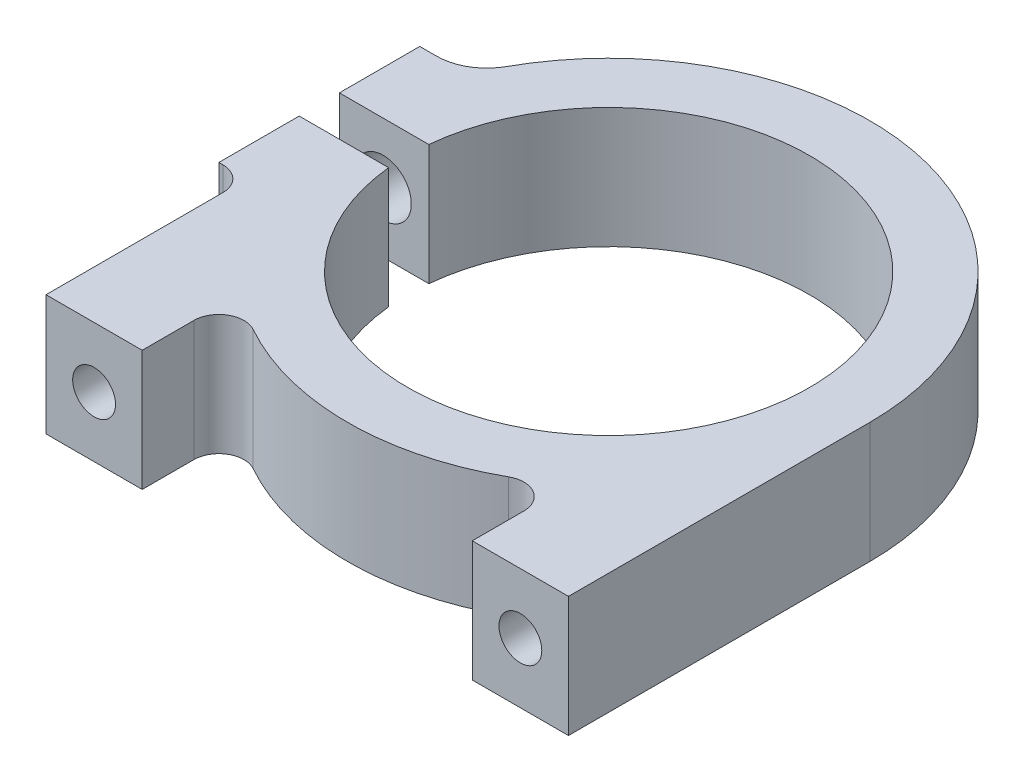
ISO-10303-21;
HEADER;
FILE_DESCRIPTION(('STEP AP214'),'2;1');
FILE_NAME('part.step','',(''),(''),'','','');
FILE_SCHEMA(('AUTOMOTIVE_DESIGN { 1 0 10303 214 1 1 1 1 }'));
ENDSEC;
DATA;
#1=APPLICATION_CONTEXT('core data for automotive mechanical design processes');
#2=APPLICATION_PROTOCOL_DEFINITION('international standard','automotive_design',2000,#1);
#3=PRODUCT_CONTEXT('',#1,'mechanical');
#4=PRODUCT('Part','Part','',(#3));
#5=PRODUCT_RELATED_PRODUCT_CATEGORY('part','',(#4));
#6=PRODUCT_DEFINITION_FORMATION('','',#4);
#7=PRODUCT_DEFINITION_CONTEXT('part definition',#1,'design');
#8=PRODUCT_DEFINITION('design','',#6,#7);
#9=PRODUCT_DEFINITION_SHAPE('','',#8);
#10=(LENGTH_UNIT() NAMED_UNIT(*) SI_UNIT(.MILLI.,.METRE.));
#11=(NAMED_UNIT(*) PLANE_ANGLE_UNIT() SI_UNIT($,.RADIAN.));
#12=(NAMED_UNIT(*) SI_UNIT($,.STERADIAN.) SOLID_ANGLE_UNIT());
#13=UNCERTAINTY_MEASURE_WITH_UNIT(LENGTH_MEASURE(1.E-05),#10,'distance_accuracy_value','');
#14=(GEOMETRIC_REPRESENTATION_CONTEXT(3) GLOBAL_UNCERTAINTY_ASSIGNED_CONTEXT((#13)) GLOBAL_UNIT_ASSIGNED_CONTEXT((#10,
#11,#12)) REPRESENTATION_CONTEXT('',''));
#15=CARTESIAN_POINT('',(0.,0.,0.));
#16=DIRECTION('',(0.,0.,1.));
#17=DIRECTION('',(1.,0.,0.));
#18=AXIS2_PLACEMENT_3D('',#15,#16,#17);
#19=CARTESIAN_POINT('',(-18.288,0.,0.));
#20=DIRECTION('',(1.,0.,0.));
#21=DIRECTION('',(0.,0.,-1.));
#22=AXIS2_PLACEMENT_3D('',#19,#20,#21);
#23=PLANE('',#22);
#24=DIRECTION('',(0.,0.,1.));
#25=VECTOR('',#24,1.);
#26=CARTESIAN_POINT('',(-18.288,0.,19.05));
#27=LINE('',#26,#25);
#28=CARTESIAN_POINT('',(-18.288,0.,-6.35));
#29=VERTEX_POINT('',#28);
#30=CARTESIAN_POINT('',(-18.288,0.,-1.27));
#31=VERTEX_POINT('',#30);
#32=EDGE_CURVE('E355',#29,#31,#27,.T.);
#33=ORIENTED_EDGE('',*,*,#32,.T.);
#34=DIRECTION('',(0.,1.,0.));
#35=VECTOR('',#34,1.);
#36=CARTESIAN_POINT('',(-18.288,0.,-1.27));
#37=LINE('',#36,#35);
#38=CARTESIAN_POINT('',(-18.288,7.62,-1.27));
#39=VERTEX_POINT('',#38);
#40=EDGE_CURVE('E254',#31,#39,#37,.T.);
#41=ORIENTED_EDGE('',*,*,#40,.T.);
#42=DIRECTION('',(0.,0.,1.));
#43=VECTOR('',#42,1.);
#44=CARTESIAN_POINT('',(-18.288,7.62,19.05));
#45=LINE('',#44,#43);
#46=CARTESIAN_POINT('',(-18.288,7.62,-6.35));
#47=VERTEX_POINT('',#46);
#48=EDGE_CURVE('E342',#47,#39,#45,.T.);
#49=ORIENTED_EDGE('',*,*,#48,.F.);
#50=DIRECTION('',(0.,-1.,0.));
#51=VECTOR('',#50,1.);
#52=CARTESIAN_POINT('',(-18.288,0.,-6.35));
#53=LINE('',#52,#51);
#54=EDGE_CURVE('E351',#47,#29,#53,.T.);
#55=ORIENTED_EDGE('',*,*,#54,.T.);
#56=EDGE_LOOP('',(#33,#41,#49,#55));
#57=FACE_BOUND('',#56,.T.);
#58=ADVANCED_FACE('F44',(#57),#23,.F.);
#59=CARTESIAN_POINT('',(0.,0.,19.05));
#60=DIRECTION('',(0.,0.,-1.));
#61=DIRECTION('',(-1.,0.,0.));
#62=AXIS2_PLACEMENT_3D('',#59,#60,#61);
#63=PLANE('',#62);
#64=CARTESIAN_POINT('',(-13.4703841816038,3.81,19.05));
#65=DIRECTION('',(0.,0.,1.));
#66=DIRECTION('',(1.,0.,0.));
#67=AXIS2_PLACEMENT_3D('',#64,#65,#66);
#68=CIRCLE('',#67,1.35254999999998);
#69=CARTESIAN_POINT('',(-12.1178341816038,3.81,19.05));
#70=VERTEX_POINT('',#69);
#71=EDGE_CURVE('E214',#70,#70,#68,.T.);
#72=ORIENTED_EDGE('',*,*,#71,.F.);
#73=EDGE_LOOP('',(#72));
#74=FACE_BOUND('',#73,.T.);
#75=DIRECTION('',(1.,0.,0.));
#76=VECTOR('',#75,1.);
#77=CARTESIAN_POINT('',(16.51,7.62,19.05));
#78=LINE('',#77,#76);
#79=CARTESIAN_POINT('',(-16.51,7.62,19.05));
#80=VERTEX_POINT('',#79);
#81=CARTESIAN_POINT('',(-10.42924,7.62,19.05));
#82=VERTEX_POINT('',#81);
#83=EDGE_CURVE('E346',#80,#82,#78,.T.);
#84=ORIENTED_EDGE('',*,*,#83,.F.);
#85=DIRECTION('',(0.,1.,0.));
#86=VECTOR('',#85,1.);
#87=CARTESIAN_POINT('',(-16.51,0.,19.05));
#88=LINE('',#87,#86);
#89=CARTESIAN_POINT('',(-16.51,0.,19.05));
#90=VERTEX_POINT('',#89);
#91=EDGE_CURVE('E284',#90,#80,#88,.T.);
#92=ORIENTED_EDGE('',*,*,#91,.F.);
#93=DIRECTION('',(1.,0.,0.));
#94=VECTOR('',#93,1.);
#95=CARTESIAN_POINT('',(16.51,0.,19.05));
#96=LINE('',#95,#94);
#97=CARTESIAN_POINT('',(-10.42924,0.,19.05));
#98=VERTEX_POINT('',#97);
#99=EDGE_CURVE('E359',#90,#98,#96,.T.);
#100=ORIENTED_EDGE('',*,*,#99,.T.);
#101=DIRECTION('',(0.,1.,0.));
#102=VECTOR('',#101,1.);
#103=CARTESIAN_POINT('',(-10.42924,0.,19.05));
#104=LINE('',#103,#102);
#105=EDGE_CURVE('E307',#98,#82,#104,.T.);
#106=ORIENTED_EDGE('',*,*,#105,.T.);
#107=EDGE_LOOP('',(#84,#92,#100,#106));
#108=FACE_BOUND('',#107,.T.);
#109=ADVANCED_FACE('F631',(#74,#108),#63,.F.);
#110=CARTESIAN_POINT('',(0.,-5.92424712516283,-6.35000000000001));
#111=DIRECTION('',(0.,0.,1.));
#112=DIRECTION('',(1.,0.,0.));
#113=AXIS2_PLACEMENT_3D('',#110,#111,#112);
#114=PLANE('',#113);
#115=CARTESIAN_POINT('',(-15.52194,3.81,-6.35));
#116=DIRECTION('',(0.,0.,-1.));
#117=DIRECTION('',(-1.,0.,0.));
#118=AXIS2_PLACEMENT_3D('',#115,#116,#117);
#119=CIRCLE('',#118,1.77799999999998);
#120=CARTESIAN_POINT('',(-17.29994,3.81,-6.35));
#121=VERTEX_POINT('',#120);
#122=EDGE_CURVE('E231',#121,#121,#119,.T.);
#123=ORIENTED_EDGE('',*,*,#122,.F.);
#124=EDGE_LOOP('',(#123));
#125=FACE_BOUND('',#124,.T.);
#126=CARTESIAN_POINT('',(-15.52194,3.81,-6.35));
#127=DIRECTION('',(0.,0.,1.));
#128=DIRECTION('',(1.,0.,0.));
#129=AXIS2_PLACEMENT_3D('',#126,#127,#128);
#130=CIRCLE('',#129,3.1115);
#131=CARTESIAN_POINT('',(-17.2271181571382,1.20734756403802,-6.35));
#132=VERTEX_POINT('',#131);
#133=CARTESIAN_POINT('',(-15.24,6.90870006396231,-6.35));
#134=VERTEX_POINT('',#133);
#135=EDGE_CURVE('E59',#132,#134,#130,.T.);
#136=ORIENTED_EDGE('',*,*,#135,.F.);
#137=DIRECTION('',(0.,-1.,0.));
#138=VECTOR('',#137,1.);
#139=CARTESIAN_POINT('',(-17.2271181571382,-5.92424712516283,-6.35));
#140=LINE('',#139,#138);
#141=CARTESIAN_POINT('',(-17.2271181571382,0.,-6.34999999999998));
#142=VERTEX_POINT('',#141);
#143=EDGE_CURVE('E613',#132,#142,#140,.T.);
#144=ORIENTED_EDGE('',*,*,#143,.T.);
#145=DIRECTION('',(1.,0.,0.));
#146=VECTOR('',#145,1.);
#147=CARTESIAN_POINT('',(-15.24,0.,-6.35));
#148=LINE('',#147,#146);
#149=EDGE_CURVE('E369',#29,#142,#148,.T.);
#150=ORIENTED_EDGE('',*,*,#149,.F.);
#151=ORIENTED_EDGE('',*,*,#54,.F.);
#152=DIRECTION('',(-1.,0.,0.));
#153=VECTOR('',#152,1.);
#154=CARTESIAN_POINT('',(-18.288,7.62,-6.35));
#155=LINE('',#154,#153);
#156=CARTESIAN_POINT('',(-17.2271181571382,7.62,-6.35));
#157=VERTEX_POINT('',#156);
#158=EDGE_CURVE('E339',#157,#47,#155,.T.);
#159=ORIENTED_EDGE('',*,*,#158,.F.);
#160=DIRECTION('',(0.,-1.,0.));
#161=VECTOR('',#160,1.);
#162=CARTESIAN_POINT('',(-17.2271181571382,-5.92424712516283,-6.35));
#163=LINE('',#162,#161);
#164=CARTESIAN_POINT('',(-17.2271181571382,6.9215,-6.35));
#165=VERTEX_POINT('',#164);
#166=EDGE_CURVE('E610',#157,#165,#163,.T.);
#167=ORIENTED_EDGE('',*,*,#166,.T.);
#168=DIRECTION('',(1.,0.,0.));
#169=VECTOR('',#168,1.);
#170=CARTESIAN_POINT('',(0.,6.9215,-6.35000000000001));
#171=LINE('',#170,#169);
#172=CARTESIAN_POINT('',(-15.52194,6.9215,-6.35));
#173=VERTEX_POINT('',#172);
#174=EDGE_CURVE('E608',#165,#173,#171,.T.);
#175=ORIENTED_EDGE('',*,*,#174,.T.);
#176=EDGE_CURVE('E450',#134,#173,#130,.T.);
#177=ORIENTED_EDGE('',*,*,#176,.F.);
#178=EDGE_LOOP('',(#136,#144,#150,#151,#159,#167,#175,#177));
#179=FACE_BOUND('',#178,.T.);
#180=ADVANCED_FACE('F628',(#125,#179),#114,.F.);
#181=CARTESIAN_POINT('',(0.,7.62,0.));
#182=DIRECTION('',(0.,-1.,0.));
#183=DIRECTION('',(0.,0.,-1.));
#184=AXIS2_PLACEMENT_3D('',#181,#182,#183);
#185=CYLINDRICAL_SURFACE('',#184,16.51);
#186=CARTESIAN_POINT('',(0.,0.,0.));
#187=DIRECTION('',(0.,-1.,0.));
#188=DIRECTION('',(0.,0.,1.));
#189=AXIS2_PLACEMENT_3D('',#186,#187,#188);
#190=CIRCLE('',#189,16.51);
#191=CARTESIAN_POINT('',(-14.4485507124385,0.,-7.98870967741936));
#192=VERTEX_POINT('',#191);
#193=CARTESIAN_POINT('',(16.51,0.,0.));
#194=VERTEX_POINT('',#193);
#195=EDGE_CURVE('E367',#192,#194,#190,.T.);
#196=ORIENTED_EDGE('',*,*,#195,.F.);
#197=DIRECTION('',(0.,-1.,0.));
#198=VECTOR('',#197,1.);
#199=CARTESIAN_POINT('',(-14.4485507124385,7.62,-7.98870967741936));
#200=LINE('',#199,#198);
#201=CARTESIAN_POINT('',(-14.4485507124385,0.889508998927032,-7.98870967741936));
#202=VERTEX_POINT('',#201);
#203=EDGE_CURVE('E605',#192,#202,#200,.F.);
#204=ORIENTED_EDGE('',*,*,#203,.T.);
#205=CARTESIAN_POINT('',(-15.52194,0.698499999999998,-5.62578693485633));
#206=CARTESIAN_POINT('',(-15.4854731339468,0.698501935198527,-5.72640178156838));
#207=CARTESIAN_POINT('',(-15.4480285974644,0.69914085929907,-5.82665954634316));
#208=CARTESIAN_POINT('',(-15.3712011060332,0.701915400420493,-6.02641939895405));
#209=CARTESIAN_POINT('',(-15.3318179624468,0.704051163361149,-6.12592141215946));
#210=CARTESIAN_POINT('',(-15.2106768864915,0.713046610535485,-6.42349717554516));
#211=CARTESIAN_POINT('',(-15.1260359831156,0.722495780826319,-6.62034081475627));
#212=CARTESIAN_POINT('',(-14.9468649019323,0.75072169890199,-7.01568023187725));
#213=CARTESIAN_POINT('',(-14.8521205006136,0.76975857320611,-7.21406105926228));
#214=CARTESIAN_POINT('',(-14.6554690209219,0.819856649529013,-7.60560697659743));
#215=CARTESIAN_POINT('',(-14.5535663919439,0.850910435294968,-7.79877520500814));
#216=CARTESIAN_POINT('',(-14.3595494275865,0.9222214640834,-8.14968004072023));
#217=CARTESIAN_POINT('',(-14.2683121497909,0.96035307355544,-8.30832771265046));
#218=CARTESIAN_POINT('',(-14.0822534115297,1.04967488154899,-8.61992773006835));
#219=CARTESIAN_POINT('',(-13.9874302518527,1.10087133875475,-8.77287730554011));
#220=CARTESIAN_POINT('',(-13.7967412399011,1.21818243562499,-9.06977436141784));
#221=CARTESIAN_POINT('',(-13.7008978732906,1.28412913625055,-9.21380152659813));
#222=CARTESIAN_POINT('',(-13.5094500807721,1.43385484181993,-9.49227674828532));
#223=CARTESIAN_POINT('',(-13.4138455100027,1.51760780905324,-9.6267384131404));
#224=CARTESIAN_POINT('',(-13.2365611111634,1.69519940127717,-9.86881340706386));
#225=CARTESIAN_POINT('',(-13.1545224753835,1.78685207129358,-9.97774640400457));
#226=CARTESIAN_POINT('',(-12.996299262153,1.98818890453879,-10.1829808278039));
#227=CARTESIAN_POINT('',(-12.9201214643911,2.09789350291981,-10.2792677142872));
#228=CARTESIAN_POINT('',(-12.7772807105275,2.33762783682913,-10.4563037337745));
#229=CARTESIAN_POINT('',(-12.7107388187093,2.467879277736,-10.5368589768487));
#230=CARTESIAN_POINT('',(-12.6232878352005,2.67644661705286,-10.6411837741476));
#231=CARTESIAN_POINT('',(-12.5962046351142,2.7481418993286,-10.6731996099616));
#232=CARTESIAN_POINT('',(-12.5468475198645,2.8955079943709,-10.7311767730148));
#233=CARTESIAN_POINT('',(-12.5245719125048,2.97117739661182,-10.7571402308536));
#234=CARTESIAN_POINT('',(-12.4744795290881,3.16971065975737,-10.8152528518619));
#235=CARTESIAN_POINT('',(-12.450648244193,3.29507343818656,-10.842602478196));
#236=CARTESIAN_POINT('',(-12.4186330826282,3.55029101457252,-10.8792585437766));
#237=CARTESIAN_POINT('',(-12.410438788011,3.68014276304775,-10.888576996123));
#238=CARTESIAN_POINT('',(-12.4104412127409,3.93993779721104,-10.8885742406293));
#239=CARTESIAN_POINT('',(-12.4186481038264,4.06988108971105,-10.8792414656128));
#240=CARTESIAN_POINT('',(-12.4506891198985,4.32519988926556,-10.8425555602648));
#241=CARTESIAN_POINT('',(-12.4745298905957,4.45057342985745,-10.815194766489));
#242=CARTESIAN_POINT('',(-12.5355616535082,4.69229431706295,-10.7443906067067));
#243=CARTESIAN_POINT('',(-12.5726724718238,4.80869087354691,-10.701043775554));
#244=CARTESIAN_POINT('',(-12.6575604300473,5.03104704827857,-10.6004995421567));
#245=CARTESIAN_POINT('',(-12.7053417729742,5.13700253011818,-10.543296681399));
#246=CARTESIAN_POINT('',(-12.8285594920242,5.37569694377296,-10.3933028350189));
#247=CARTESIAN_POINT('',(-12.9075964945359,5.50326005145146,-10.2952563560163));
#248=CARTESIAN_POINT('',(-13.0745661498142,5.73678785555393,-10.0823692291421));
#249=CARTESIAN_POINT('',(-13.1625186030926,5.84270282819026,-9.96749093566345));
#250=CARTESIAN_POINT('',(-13.3203855676183,6.01100486649576,-9.75502194917827));
#251=CARTESIAN_POINT('',(-13.3894277950024,6.07769461852777,-9.66011039948918));
#252=CARTESIAN_POINT('',(-13.5284513079876,6.20082935415329,-9.46443363653409));
#253=CARTESIAN_POINT('',(-13.5984331200514,6.25726831281466,-9.36366502639403));
#254=CARTESIAN_POINT('',(-13.7382257859873,6.36095544800978,-9.15733602313892));
#255=CARTESIAN_POINT('',(-13.8080365054791,6.40819785127885,-9.05177267100614));
#256=CARTESIAN_POINT('',(-13.9466143605487,6.49448145996615,-8.83676430956491));
#257=CARTESIAN_POINT('',(-14.0153818148847,6.53352521919709,-8.72732052143447));
#258=CARTESIAN_POINT('',(-14.1458476590917,6.60155346436489,-8.51407335114997));
#259=CARTESIAN_POINT('',(-14.2076707247308,6.63109352331868,-8.41052139939679));
#260=CARTESIAN_POINT('',(-14.3295036379936,6.68470807727247,-8.20122382523562));
#261=CARTESIAN_POINT('',(-14.3895163435949,6.70879162513591,-8.09548215872386));
#262=CARTESIAN_POINT('',(-14.5518362553677,6.76845586575748,-7.80190233252084));
#263=CARTESIAN_POINT('',(-14.6521270688316,6.79912268111244,-7.61193962071112));
#264=CARTESIAN_POINT('',(-14.8457885817442,6.84878933086103,-7.22697450196913));
#265=CARTESIAN_POINT('',(-14.9391553112033,6.86778251685641,-7.03196928897042));
#266=CARTESIAN_POINT('',(-15.1187451427038,6.89661114338037,-6.63708412002955));
#267=CARTESIAN_POINT('',(-15.2049372228497,6.90640852535362,-6.4371873880516));
#268=CARTESIAN_POINT('',(-15.3694193041687,6.9188534923508,-6.03394419503236));
#269=CARTESIAN_POINT('',(-15.447708246365,6.9215001204341,-5.83059727593784));
#270=CARTESIAN_POINT('',(-15.5964919856263,6.92149987904635,-5.42009305243084));
#271=CARTESIAN_POINT('',(-15.6669517021781,6.91883012444324,-5.21292309452853));
#272=CARTESIAN_POINT('',(-15.7995650941259,6.90980153948929,-4.7960089518498));
#273=CARTESIAN_POINT('',(-15.8617179987305,6.90344236708842,-4.58626453015706));
#274=CARTESIAN_POINT('',(-15.9771442662327,6.88856964177688,-4.16629240786288));
#275=CARTESIAN_POINT('',(-16.0304867177044,6.88007431334647,-3.95608300151204));
#276=CARTESIAN_POINT('',(-16.1288330264427,6.86214123416271,-3.53381376626691));
#277=CARTESIAN_POINT('',(-16.1738388451176,6.85270370589242,-3.3217543849526));
#278=CARTESIAN_POINT('',(-16.2146510364849,6.84341122664435,-3.10888915289983));
#279=B_SPLINE_CURVE_WITH_KNOTS('',3,(#205,#206,#207,#208,#209,#210,#211,#212,#213,#214,#215,
#216,#217,#218,#219,#220,#221,#222,#223,#224,#225,#226,#227,#228,#229,#230,#231,#232,#233,#234,
#235,#236,#237,#238,#239,#240,#241,#242,#243,#244,#245,#246,#247,#248,#249,#250,#251,#252,#253,
#254,#255,#256,#257,#258,#259,#260,#261,#262,#263,#264,#265,#266,#267,#268,#269,#270,#271,#272,
#273,#274,#275,#276,#277,#278),.UNSPECIFIED.,.F.,.F.,(4,2,2,2,2,2,2,2,2,2,2,2,2,2,2,2,2,2,2,2,2,
2,2,2,2,2,2,2,2,2,2,2,2,2,2,2,4),(0.,0.321044843708941,0.642120988923724,1.28522901489469,
1.94680948495497,2.60798230924182,3.16832940357913,3.72894543642441,4.28347704413504,
4.83720328215382,5.32880159982016,5.82096029438146,6.31884729005702,6.56762858894505,
6.81632217743627,7.2055950302454,7.59460844426166,7.98386319270059,8.37328351442394,
8.76038975410506,9.14764874106464,9.68245135557348,10.2184688901509,10.6229008925865,
11.027569837202,11.4324920048673,11.8372878547669,12.209624373644,12.5813385524531,
13.2316834536493,13.8823983987253,14.5357947257388,15.1892784883614,15.8455813465377,
16.5019450610084,17.1528885398903,17.8036786724265),.UNSPECIFIED.);
#280=EDGE_CURVE('E378',#202,#134,#279,.T.);
#281=ORIENTED_EDGE('',*,*,#280,.T.);
#282=CARTESIAN_POINT('',(-15.52194,6.9215,-5.62578693485633));
#283=VERTEX_POINT('',#282);
#284=EDGE_CURVE('E379',#134,#283,#279,.T.);
#285=ORIENTED_EDGE('',*,*,#284,.T.);
#286=CARTESIAN_POINT('',(0.,6.9215,0.));
#287=DIRECTION('',(0.,-1.,0.));
#288=DIRECTION('',(0.,0.,-1.));
#289=AXIS2_PLACEMENT_3D('',#286,#287,#288);
#290=CIRCLE('',#289,16.51);
#291=CARTESIAN_POINT('',(-14.4485507124385,6.9215,-7.98870967741936));
#292=VERTEX_POINT('',#291);
#293=EDGE_CURVE('E348',#292,#283,#290,.F.);
#294=ORIENTED_EDGE('',*,*,#293,.F.);
#295=DIRECTION('',(0.,-1.,0.));
#296=VECTOR('',#295,1.);
#297=CARTESIAN_POINT('',(-14.4485507124385,7.62,-7.98870967741936));
#298=LINE('',#297,#296);
#299=CARTESIAN_POINT('',(-14.4485507124385,7.62,-7.98870967741935));
#300=VERTEX_POINT('',#299);
#301=EDGE_CURVE('E603',#292,#300,#298,.F.);
#302=ORIENTED_EDGE('',*,*,#301,.T.);
#303=CARTESIAN_POINT('',(0.,7.62,0.));
#304=DIRECTION('',(0.,1.,0.));
#305=DIRECTION('',(0.,0.,-1.));
#306=AXIS2_PLACEMENT_3D('',#303,#304,#305);
#307=CIRCLE('',#306,16.51);
#308=CARTESIAN_POINT('',(16.51,7.62,0.));
#309=VERTEX_POINT('',#308);
#310=EDGE_CURVE('E336',#309,#300,#307,.T.);
#311=ORIENTED_EDGE('',*,*,#310,.F.);
#312=DIRECTION('',(0.,-1.,0.));
#313=VECTOR('',#312,1.);
#314=CARTESIAN_POINT('',(16.51,7.62,0.));
#315=LINE('',#314,#313);
#316=EDGE_CURVE('E373',#309,#194,#315,.T.);
#317=ORIENTED_EDGE('',*,*,#316,.T.);
#318=EDGE_LOOP('',(#196,#204,#281,#285,#294,#302,#311,#317));
#319=FACE_BOUND('',#318,.T.);
#320=ADVANCED_FACE('F630',(#319),#185,.T.);
#321=CARTESIAN_POINT('',(-15.52194,3.81,-16.51));
#322=DIRECTION('',(0.,0.,1.));
#323=DIRECTION('',(1.,0.,0.));
#324=AXIS2_PLACEMENT_3D('',#321,#322,#323);
#325=CYLINDRICAL_SURFACE('',#324,3.1115);
#326=ORIENTED_EDGE('',*,*,#284,.F.);
#327=ORIENTED_EDGE('',*,*,#176,.T.);
#328=DIRECTION('',(0.,0.,1.));
#329=VECTOR('',#328,1.);
#330=CARTESIAN_POINT('',(-15.52194,6.9215,-16.51));
#331=LINE('',#330,#329);
#332=EDGE_CURVE('E372',#283,#173,#331,.F.);
#333=ORIENTED_EDGE('',*,*,#332,.F.);
#334=EDGE_LOOP('',(#326,#327,#333));
#335=FACE_BOUND('',#334,.T.);
#336=ADVANCED_FACE('F637',(#335),#325,.T.);
#337=ORIENTED_EDGE('',*,*,#135,.T.);
#338=ORIENTED_EDGE('',*,*,#280,.F.);
#339=CARTESIAN_POINT('',(-14.4485507124385,0.889508998927032,-7.98870967741936));
#340=CARTESIAN_POINT('',(-14.4886987378315,0.874760879645998,-7.91612332464799));
#341=CARTESIAN_POINT('',(-14.5316371216836,0.859912671676937,-7.84516262749067));
#342=CARTESIAN_POINT('',(-14.6230441560755,0.830782375128718,-7.70666406522509));
#343=CARTESIAN_POINT('',(-14.6715186881576,0.816500910761228,-7.63912995254409));
#344=CARTESIAN_POINT('',(-14.8259249169088,0.775470407790247,-7.44100881868331));
#345=CARTESIAN_POINT('',(-14.9401355354262,0.750820398016488,-7.31617990170038));
#346=CARTESIAN_POINT('',(-15.1262301950829,0.723120724605173,-7.14294910224273));
#347=CARTESIAN_POINT('',(-15.1909447634434,0.715424248572022,-7.08739332337228));
#348=CARTESIAN_POINT('',(-15.3248522914516,0.704022758928312,-6.98152283696505));
#349=CARTESIAN_POINT('',(-15.3940428487065,0.700315622660214,-6.93120535510949));
#350=CARTESIAN_POINT('',(-15.5360014998013,0.697725638682116,-6.83650620935903));
#351=CARTESIAN_POINT('',(-15.6087514693995,0.698820446558317,-6.79209804145587));
#352=CARTESIAN_POINT('',(-15.7573645297366,0.706528077748045,-6.70938747967627));
#353=CARTESIAN_POINT('',(-15.8332268756484,0.713139588091549,-6.67108363555968));
#354=CARTESIAN_POINT('',(-15.9771256489235,0.731234967524523,-6.6054860195793));
#355=CARTESIAN_POINT('',(-16.0448994741688,0.741974861079356,-6.57740846039323));
#356=CARTESIAN_POINT('',(-16.1813701010614,0.768386533110929,-6.52627636040613));
#357=CARTESIAN_POINT('',(-16.2500667661653,0.784057589502231,-6.50322108501249));
#358=CARTESIAN_POINT('',(-16.387711816861,0.820527519413352,-6.46212762517247));
#359=CARTESIAN_POINT('',(-16.4566604185544,0.841333403191999,-6.44409637196259));
#360=CARTESIAN_POINT('',(-16.5938956268064,0.888082564057313,-6.41298979842455));
#361=CARTESIAN_POINT('',(-16.6621824066349,0.914024456177342,-6.39991314481194));
#362=CARTESIAN_POINT('',(-16.8159504393406,0.978799951369908,-6.37552952798496));
#363=CARTESIAN_POINT('',(-16.9010092972413,1.01921780999546,-6.36569228538282));
#364=CARTESIAN_POINT('',(-17.0256994444814,1.08559940557659,-6.35612086684779));
#365=CARTESIAN_POINT('',(-17.0667313770473,1.10865403563149,-6.3537941588719));
#366=CARTESIAN_POINT('',(-17.1477410905054,1.1566216572003,-6.35073396745706));
#367=CARTESIAN_POINT('',(-17.1877191523694,1.18153414646866,-6.35000005503207));
#368=CARTESIAN_POINT('',(-17.2271181571382,1.20734756403802,-6.35));
#369=B_SPLINE_CURVE_WITH_KNOTS('',3,(#339,#340,#341,#342,#343,#344,#345,#346,#347,#348,#349,
#350,#351,#352,#353,#354,#355,#356,#357,#358,#359,#360,#361,#362,#363,#364,#365,#366,#367,#368),
.UNSPECIFIED.,.F.,.F.,(4,2,2,2,2,2,2,2,2,2,2,2,2,2,4),(0.,0.252579824676068,0.505430528279235,
1.01554305298503,1.27216740732666,1.52865514874507,1.78395067039063,2.03918544926583,
2.261284851101,2.48335174535613,2.70572350722992,2.92803538621414,3.21133737351597,
3.35264309569458,3.49391075541777),.UNSPECIFIED.);
#370=EDGE_CURVE('E615',#202,#132,#369,.T.);
#371=ORIENTED_EDGE('',*,*,#370,.T.);
#372=EDGE_LOOP('',(#337,#338,#371));
#373=FACE_BOUND('',#372,.T.);
#374=ADVANCED_FACE('F621',(#373),#325,.F.);
#375=CARTESIAN_POINT('',(0.,0.,0.));
#376=DIRECTION('',(0.,1.,0.));
#377=DIRECTION('',(0.,0.,1.));
#378=AXIS2_PLACEMENT_3D('',#375,#376,#377);
#379=PLANE('',#378);
#380=DIRECTION('',(1.,0.,0.));
#381=VECTOR('',#380,1.);
#382=CARTESIAN_POINT('',(-18.288,0.,1.27));
#383=LINE('',#382,#381);
#384=CARTESIAN_POINT('',(-18.288,0.,1.27));
#385=VERTEX_POINT('',#384);
#386=CARTESIAN_POINT('',(-12.6363404512541,0.,1.27));
#387=VERTEX_POINT('',#386);
#388=EDGE_CURVE('E243',#385,#387,#383,.T.);
#389=ORIENTED_EDGE('',*,*,#388,.T.);
#390=CARTESIAN_POINT('',(0.,0.,0.));
#391=DIRECTION('',(0.,1.,0.));
#392=DIRECTION('',(0.,0.,1.));
#393=AXIS2_PLACEMENT_3D('',#390,#391,#392);
#394=CIRCLE('',#393,12.7);
#395=CARTESIAN_POINT('',(-12.6363404512541,0.,-1.27));
#396=VERTEX_POINT('',#395);
#397=EDGE_CURVE('E239',#387,#396,#394,.T.);
#398=ORIENTED_EDGE('',*,*,#397,.T.);
#399=DIRECTION('',(-1.,0.,0.));
#400=VECTOR('',#399,1.);
#401=CARTESIAN_POINT('',(-12.6363404512541,0.,-1.27));
#402=LINE('',#401,#400);
#403=EDGE_CURVE('E246',#396,#31,#402,.T.);
#404=ORIENTED_EDGE('',*,*,#403,.T.);
#405=ORIENTED_EDGE('',*,*,#32,.F.);
#406=ORIENTED_EDGE('',*,*,#149,.T.);
#407=CARTESIAN_POINT('',(-17.2271181571382,0.,-9.525));
#408=DIRECTION('',(0.,1.,0.));
#409=DIRECTION('',(0.,0.,1.));
#410=AXIS2_PLACEMENT_3D('',#407,#408,#409);
#411=CIRCLE('',#410,3.175);
#412=EDGE_CURVE('E620',#142,#192,#411,.T.);
#413=ORIENTED_EDGE('',*,*,#412,.T.);
#414=ORIENTED_EDGE('',*,*,#195,.T.);
#415=DIRECTION('',(0.,0.,-1.));
#416=VECTOR('',#415,1.);
#417=CARTESIAN_POINT('',(16.51,0.,19.05));
#418=LINE('',#417,#416);
#419=CARTESIAN_POINT('',(16.51,0.,19.05));
#420=VERTEX_POINT('',#419);
#421=EDGE_CURVE('E364',#420,#194,#418,.T.);
#422=ORIENTED_EDGE('',*,*,#421,.F.);
#423=CARTESIAN_POINT('',(10.42924,0.,19.05));
#424=VERTEX_POINT('',#423);
#425=EDGE_CURVE('E358',#424,#420,#96,.T.);
#426=ORIENTED_EDGE('',*,*,#425,.F.);
#427=DIRECTION('',(0.,0.,-1.));
#428=VECTOR('',#427,1.);
#429=CARTESIAN_POINT('',(10.42924,0.,19.05));
#430=LINE('',#429,#428);
#431=CARTESIAN_POINT('',(10.42924,0.,15.7862689918549));
#432=VERTEX_POINT('',#431);
#433=EDGE_CURVE('E294',#424,#432,#430,.T.);
#434=ORIENTED_EDGE('',*,*,#433,.T.);
#435=CARTESIAN_POINT('',(8.84428,0.,15.7862689918549));
#436=DIRECTION('',(0.,1.,0.));
#437=DIRECTION('',(0.,0.,1.));
#438=AXIS2_PLACEMENT_3D('',#435,#436,#437);
#439=CIRCLE('',#438,1.58496);
#440=CARTESIAN_POINT('',(8.06959854014598,0.,14.4035301020574));
#441=VERTEX_POINT('',#440);
#442=EDGE_CURVE('E298',#432,#441,#439,.T.);
#443=ORIENTED_EDGE('',*,*,#442,.T.);
#444=CARTESIAN_POINT('',(0.,0.,0.));
#445=DIRECTION('',(0.,-1.,0.));
#446=DIRECTION('',(0.,0.,-1.));
#447=AXIS2_PLACEMENT_3D('',#444,#445,#446);
#448=CIRCLE('',#447,16.51);
#449=CARTESIAN_POINT('',(-8.06959854014599,0.,14.4035301020574));
#450=VERTEX_POINT('',#449);
#451=EDGE_CURVE('E301',#441,#450,#448,.T.);
#452=ORIENTED_EDGE('',*,*,#451,.T.);
#453=CARTESIAN_POINT('',(-8.84428,0.,15.7862689918549));
#454=DIRECTION('',(0.,1.,0.));
#455=DIRECTION('',(0.,0.,1.));
#456=AXIS2_PLACEMENT_3D('',#453,#454,#455);
#457=CIRCLE('',#456,1.58496);
#458=CARTESIAN_POINT('',(-10.42924,0.,15.7862689918549));
#459=VERTEX_POINT('',#458);
#460=EDGE_CURVE('E304',#450,#459,#457,.T.);
#461=ORIENTED_EDGE('',*,*,#460,.T.);
#462=DIRECTION('',(0.,0.,1.));
#463=VECTOR('',#462,1.);
#464=CARTESIAN_POINT('',(-10.42924,0.,15.7862689918549));
#465=LINE('',#464,#463);
#466=EDGE_CURVE('E291',#459,#98,#465,.T.);
#467=ORIENTED_EDGE('',*,*,#466,.T.);
#468=ORIENTED_EDGE('',*,*,#99,.F.);
#469=DIRECTION('',(0.,0.,-1.));
#470=VECTOR('',#469,1.);
#471=CARTESIAN_POINT('',(-16.51,0.,19.05));
#472=LINE('',#471,#470);
#473=CARTESIAN_POINT('',(-16.51,0.,7.874));
#474=VERTEX_POINT('',#473);
#475=EDGE_CURVE('E271',#90,#474,#472,.T.);
#476=ORIENTED_EDGE('',*,*,#475,.T.);
#477=CARTESIAN_POINT('',(-18.034,0.,7.874));
#478=DIRECTION('',(0.,1.,0.));
#479=DIRECTION('',(0.,0.,1.));
#480=AXIS2_PLACEMENT_3D('',#477,#478,#479);
#481=CIRCLE('',#480,1.524);
#482=CARTESIAN_POINT('',(-18.034,0.,6.35));
#483=VERTEX_POINT('',#482);
#484=EDGE_CURVE('E264',#474,#483,#481,.T.);
#485=ORIENTED_EDGE('',*,*,#484,.T.);
#486=DIRECTION('',(-1.,0.,0.));
#487=VECTOR('',#486,1.);
#488=CARTESIAN_POINT('',(-18.034,0.,6.35));
#489=LINE('',#488,#487);
#490=CARTESIAN_POINT('',(-18.288,0.,6.35));
#491=VERTEX_POINT('',#490);
#492=EDGE_CURVE('E267',#483,#491,#489,.T.);
#493=ORIENTED_EDGE('',*,*,#492,.T.);
#494=EDGE_CURVE('E354',#385,#491,#27,.T.);
#495=ORIENTED_EDGE('',*,*,#494,.F.);
#496=EDGE_LOOP('',(#389,#398,#404,#405,#406,#413,#414,#422,#426,#434,#443,#452,#461,#467,#468,
#476,#485,#493,#495));
#497=FACE_BOUND('',#496,.T.);
#498=ADVANCED_FACE('F689',(#497),#379,.F.);
#499=CARTESIAN_POINT('',(16.51,6.9215,19.05));
#500=DIRECTION('',(-1.,0.,0.));
#501=DIRECTION('',(0.,0.,1.));
#502=AXIS2_PLACEMENT_3D('',#499,#500,#501);
#503=PLANE('',#502);
#504=ORIENTED_EDGE('',*,*,#316,.F.);
#505=DIRECTION('',(0.,0.,-1.));
#506=VECTOR('',#505,1.);
#507=CARTESIAN_POINT('',(16.51,7.62,0.));
#508=LINE('',#507,#506);
#509=CARTESIAN_POINT('',(16.51,7.62,19.05));
#510=VERTEX_POINT('',#509);
#511=EDGE_CURVE('E323',#510,#309,#508,.T.);
#512=ORIENTED_EDGE('',*,*,#511,.F.);
#513=DIRECTION('',(0.,1.,0.));
#514=VECTOR('',#513,1.);
#515=CARTESIAN_POINT('',(16.51,6.9215,19.05));
#516=LINE('',#515,#514);
#517=EDGE_CURVE('E361',#420,#510,#516,.T.);
#518=ORIENTED_EDGE('',*,*,#517,.F.);
#519=ORIENTED_EDGE('',*,*,#421,.T.);
#520=EDGE_LOOP('',(#504,#512,#518,#519));
#521=FACE_BOUND('',#520,.T.);
#522=ADVANCED_FACE('F660',(#521),#503,.F.);
#523=CARTESIAN_POINT('',(13.4703841816038,3.81,19.05));
#524=DIRECTION('',(0.,0.,1.));
#525=DIRECTION('',(1.,0.,0.));
#526=AXIS2_PLACEMENT_3D('',#523,#524,#525);
#527=CIRCLE('',#526,1.35254999999998);
#528=CARTESIAN_POINT('',(14.8229341816037,3.81,19.05));
#529=VERTEX_POINT('',#528);
#530=EDGE_CURVE('E225',#529,#529,#527,.T.);
#531=ORIENTED_EDGE('',*,*,#530,.F.);
#532=EDGE_LOOP('',(#531));
#533=FACE_BOUND('',#532,.T.);
#534=CARTESIAN_POINT('',(10.42924,7.62,19.05));
#535=VERTEX_POINT('',#534);
#536=EDGE_CURVE('E345',#535,#510,#78,.T.);
#537=ORIENTED_EDGE('',*,*,#536,.F.);
#538=DIRECTION('',(0.,1.,0.));
#539=VECTOR('',#538,1.);
#540=CARTESIAN_POINT('',(10.42924,0.,19.05));
#541=LINE('',#540,#539);
#542=EDGE_CURVE('E330',#424,#535,#541,.T.);
#543=ORIENTED_EDGE('',*,*,#542,.F.);
#544=ORIENTED_EDGE('',*,*,#425,.T.);
#545=ORIENTED_EDGE('',*,*,#517,.T.);
#546=EDGE_LOOP('',(#537,#543,#544,#545));
#547=FACE_BOUND('',#546,.T.);
#548=ADVANCED_FACE('F641',(#533,#547),#63,.F.);
#549=CARTESIAN_POINT('',(-18.288,7.62,1.27));
#550=VERTEX_POINT('',#549);
#551=CARTESIAN_POINT('',(-18.288,7.62,6.35));
#552=VERTEX_POINT('',#551);
#553=EDGE_CURVE('E341',#550,#552,#45,.T.);
#554=ORIENTED_EDGE('',*,*,#553,.F.);
#555=DIRECTION('',(0.,1.,0.));
#556=VECTOR('',#555,1.);
#557=CARTESIAN_POINT('',(-18.288,0.,1.27));
#558=LINE('',#557,#556);
#559=EDGE_CURVE('E250',#385,#550,#558,.T.);
#560=ORIENTED_EDGE('',*,*,#559,.F.);
#561=ORIENTED_EDGE('',*,*,#494,.T.);
#562=DIRECTION('',(0.,1.,0.));
#563=VECTOR('',#562,1.);
#564=CARTESIAN_POINT('',(-18.288,0.,6.35));
#565=LINE('',#564,#563);
#566=EDGE_CURVE('E286',#491,#552,#565,.T.);
#567=ORIENTED_EDGE('',*,*,#566,.T.);
#568=EDGE_LOOP('',(#554,#560,#561,#567));
#569=FACE_BOUND('',#568,.T.);
#570=ADVANCED_FACE('F646',(#569),#23,.F.);
#571=CARTESIAN_POINT('',(0.,7.62,0.));
#572=DIRECTION('',(0.,-1.,0.));
#573=DIRECTION('',(0.,0.,-1.));
#574=AXIS2_PLACEMENT_3D('',#571,#572,#573);
#575=PLANE('',#574);
#576=DIRECTION('',(-1.,0.,0.));
#577=VECTOR('',#576,1.);
#578=CARTESIAN_POINT('',(-12.6363404512541,7.62,-1.27));
#579=LINE('',#578,#577);
#580=CARTESIAN_POINT('',(-12.6363404512541,7.62,-1.27));
#581=VERTEX_POINT('',#580);
#582=EDGE_CURVE('E247',#581,#39,#579,.T.);
#583=ORIENTED_EDGE('',*,*,#582,.F.);
#584=CARTESIAN_POINT('',(0.,7.62,0.));
#585=DIRECTION('',(0.,1.,0.));
#586=DIRECTION('',(0.,0.,1.));
#587=AXIS2_PLACEMENT_3D('',#584,#585,#586);
#588=CIRCLE('',#587,12.7);
#589=CARTESIAN_POINT('',(-12.6363404512541,7.62,1.27));
#590=VERTEX_POINT('',#589);
#591=EDGE_CURVE('E237',#590,#581,#588,.T.);
#592=ORIENTED_EDGE('',*,*,#591,.F.);
#593=DIRECTION('',(1.,0.,0.));
#594=VECTOR('',#593,1.);
#595=CARTESIAN_POINT('',(-18.288,7.62,1.27));
#596=LINE('',#595,#594);
#597=EDGE_CURVE('E242',#550,#590,#596,.T.);
#598=ORIENTED_EDGE('',*,*,#597,.F.);
#599=ORIENTED_EDGE('',*,*,#553,.T.);
#600=DIRECTION('',(-1.,0.,0.));
#601=VECTOR('',#600,1.);
#602=CARTESIAN_POINT('',(-18.034,7.62,6.35));
#603=LINE('',#602,#601);
#604=CARTESIAN_POINT('',(-18.034,7.62,6.35));
#605=VERTEX_POINT('',#604);
#606=EDGE_CURVE('E276',#605,#552,#603,.T.);
#607=ORIENTED_EDGE('',*,*,#606,.F.);
#608=CARTESIAN_POINT('',(-18.034,7.62,7.874));
#609=DIRECTION('',(0.,1.,0.));
#610=DIRECTION('',(0.,0.,1.));
#611=AXIS2_PLACEMENT_3D('',#608,#609,#610);
#612=CIRCLE('',#611,1.524);
#613=CARTESIAN_POINT('',(-16.51,7.62,7.874));
#614=VERTEX_POINT('',#613);
#615=EDGE_CURVE('E257',#614,#605,#612,.T.);
#616=ORIENTED_EDGE('',*,*,#615,.F.);
#617=DIRECTION('',(0.,0.,-1.));
#618=VECTOR('',#617,1.);
#619=CARTESIAN_POINT('',(-16.51,7.62,19.05));
#620=LINE('',#619,#618);
#621=EDGE_CURVE('E268',#80,#614,#620,.T.);
#622=ORIENTED_EDGE('',*,*,#621,.F.);
#623=ORIENTED_EDGE('',*,*,#83,.T.);
#624=DIRECTION('',(0.,0.,1.));
#625=VECTOR('',#624,1.);
#626=CARTESIAN_POINT('',(-10.42924,7.62,15.7862689918549));
#627=LINE('',#626,#625);
#628=CARTESIAN_POINT('',(-10.42924,7.62,15.7862689918549));
#629=VERTEX_POINT('',#628);
#630=EDGE_CURVE('E283',#629,#82,#627,.T.);
#631=ORIENTED_EDGE('',*,*,#630,.F.);
#632=CARTESIAN_POINT('',(-8.84428,7.62,15.7862689918549));
#633=DIRECTION('',(0.,1.,0.));
#634=DIRECTION('',(0.,0.,1.));
#635=AXIS2_PLACEMENT_3D('',#632,#633,#634);
#636=CIRCLE('',#635,1.58496);
#637=CARTESIAN_POINT('',(-8.06959854014599,7.62,14.4035301020574));
#638=VERTEX_POINT('',#637);
#639=EDGE_CURVE('E295',#638,#629,#636,.T.);
#640=ORIENTED_EDGE('',*,*,#639,.F.);
#641=CARTESIAN_POINT('',(0.,7.62,0.));
#642=DIRECTION('',(0.,-1.,0.));
#643=DIRECTION('',(0.,0.,-1.));
#644=AXIS2_PLACEMENT_3D('',#641,#642,#643);
#645=CIRCLE('',#644,16.51);
#646=CARTESIAN_POINT('',(8.06959854014598,7.62,14.4035301020574));
#647=VERTEX_POINT('',#646);
#648=EDGE_CURVE('E316',#647,#638,#645,.T.);
#649=ORIENTED_EDGE('',*,*,#648,.F.);
#650=CARTESIAN_POINT('',(8.84428,7.62,15.7862689918549));
#651=DIRECTION('',(0.,1.,0.));
#652=DIRECTION('',(0.,0.,1.));
#653=AXIS2_PLACEMENT_3D('',#650,#651,#652);
#654=CIRCLE('',#653,1.58496);
#655=CARTESIAN_POINT('',(10.42924,7.62,15.7862689918549));
#656=VERTEX_POINT('',#655);
#657=EDGE_CURVE('E313',#656,#647,#654,.T.);
#658=ORIENTED_EDGE('',*,*,#657,.F.);
#659=DIRECTION('',(0.,0.,-1.));
#660=VECTOR('',#659,1.);
#661=CARTESIAN_POINT('',(10.42924,7.62,19.05));
#662=LINE('',#661,#660);
#663=EDGE_CURVE('E310',#535,#656,#662,.T.);
#664=ORIENTED_EDGE('',*,*,#663,.F.);
#665=ORIENTED_EDGE('',*,*,#536,.T.);
#666=ORIENTED_EDGE('',*,*,#511,.T.);
#667=ORIENTED_EDGE('',*,*,#310,.T.);
#668=CARTESIAN_POINT('',(-17.2271181571382,7.62,-9.525));
#669=DIRECTION('',(0.,-1.,0.));
#670=DIRECTION('',(0.,0.,-1.));
#671=AXIS2_PLACEMENT_3D('',#668,#669,#670);
#672=CIRCLE('',#671,3.175);
#673=EDGE_CURVE('E12',#300,#157,#672,.T.);
#674=ORIENTED_EDGE('',*,*,#673,.T.);
#675=ORIENTED_EDGE('',*,*,#158,.T.);
#676=ORIENTED_EDGE('',*,*,#48,.T.);
#677=EDGE_LOOP('',(#583,#592,#598,#599,#607,#616,#622,#623,#631,#640,#649,#658,#664,#665,#666,
#667,#674,#675,#676));
#678=FACE_BOUND('',#677,.T.);
#679=ADVANCED_FACE('F651',(#678),#575,.F.);
#680=CARTESIAN_POINT('',(0.,6.9215,0.));
#681=DIRECTION('',(0.,-1.,0.));
#682=DIRECTION('',(0.,0.,-1.));
#683=AXIS2_PLACEMENT_3D('',#680,#681,#682);
#684=PLANE('',#683);
#685=ORIENTED_EDGE('',*,*,#332,.T.);
#686=ORIENTED_EDGE('',*,*,#174,.F.);
#687=CARTESIAN_POINT('',(-17.2271181571382,6.9215,-9.525));
#688=DIRECTION('',(0.,-1.,0.));
#689=DIRECTION('',(0.,0.,-1.));
#690=AXIS2_PLACEMENT_3D('',#687,#688,#689);
#691=CIRCLE('',#690,3.175);
#692=EDGE_CURVE('E52',#165,#292,#691,.F.);
#693=ORIENTED_EDGE('',*,*,#692,.T.);
#694=ORIENTED_EDGE('',*,*,#293,.T.);
#695=EDGE_LOOP('',(#685,#686,#693,#694));
#696=FACE_BOUND('',#695,.T.);
#697=ADVANCED_FACE('F657',(#696),#684,.T.);
#698=CARTESIAN_POINT('',(-10.42924,0.,15.7862689918549));
#699=DIRECTION('',(-1.,0.,0.));
#700=DIRECTION('',(0.,0.,1.));
#701=AXIS2_PLACEMENT_3D('',#698,#699,#700);
#702=PLANE('',#701);
#703=ORIENTED_EDGE('',*,*,#630,.T.);
#704=ORIENTED_EDGE('',*,*,#105,.F.);
#705=ORIENTED_EDGE('',*,*,#466,.F.);
#706=DIRECTION('',(0.,1.,0.));
#707=VECTOR('',#706,1.);
#708=CARTESIAN_POINT('',(-10.42924,0.,15.7862689918549));
#709=LINE('',#708,#707);
#710=EDGE_CURVE('E321',#459,#629,#709,.T.);
#711=ORIENTED_EDGE('',*,*,#710,.T.);
#712=EDGE_LOOP('',(#703,#704,#705,#711));
#713=FACE_BOUND('',#712,.T.);
#714=ADVANCED_FACE('F687',(#713),#702,.F.);
#715=CARTESIAN_POINT('',(-8.84428,0.,15.7862689918549));
#716=DIRECTION('',(0.,1.,0.));
#717=DIRECTION('',(0.,0.,1.));
#718=AXIS2_PLACEMENT_3D('',#715,#716,#717);
#719=CYLINDRICAL_SURFACE('',#718,1.58496);
#720=ORIENTED_EDGE('',*,*,#639,.T.);
#721=ORIENTED_EDGE('',*,*,#710,.F.);
#722=ORIENTED_EDGE('',*,*,#460,.F.);
#723=DIRECTION('',(0.,1.,0.));
#724=VECTOR('',#723,1.);
#725=CARTESIAN_POINT('',(-8.06959854014599,0.,14.4035301020574));
#726=LINE('',#725,#724);
#727=EDGE_CURVE('E324',#450,#638,#726,.T.);
#728=ORIENTED_EDGE('',*,*,#727,.T.);
#729=EDGE_LOOP('',(#720,#721,#722,#728));
#730=FACE_BOUND('',#729,.T.);
#731=ADVANCED_FACE('F693',(#730),#719,.F.);
#732=CARTESIAN_POINT('',(0.,0.,0.));
#733=DIRECTION('',(0.,1.,0.));
#734=DIRECTION('',(0.,0.,1.));
#735=AXIS2_PLACEMENT_3D('',#732,#733,#734);
#736=CYLINDRICAL_SURFACE('',#735,16.51);
#737=ORIENTED_EDGE('',*,*,#648,.T.);
#738=ORIENTED_EDGE('',*,*,#727,.F.);
#739=ORIENTED_EDGE('',*,*,#451,.F.);
#740=DIRECTION('',(0.,1.,0.));
#741=VECTOR('',#740,1.);
#742=CARTESIAN_POINT('',(8.06959854014598,0.,14.4035301020574));
#743=LINE('',#742,#741);
#744=EDGE_CURVE('E326',#441,#647,#743,.T.);
#745=ORIENTED_EDGE('',*,*,#744,.T.);
#746=EDGE_LOOP('',(#737,#738,#739,#745));
#747=FACE_BOUND('',#746,.T.);
#748=ADVANCED_FACE('F699',(#747),#736,.T.);
#749=CARTESIAN_POINT('',(8.84428,0.,15.7862689918549));
#750=DIRECTION('',(0.,1.,0.));
#751=DIRECTION('',(0.,0.,1.));
#752=AXIS2_PLACEMENT_3D('',#749,#750,#751);
#753=CYLINDRICAL_SURFACE('',#752,1.58496);
#754=ORIENTED_EDGE('',*,*,#657,.T.);
#755=ORIENTED_EDGE('',*,*,#744,.F.);
#756=ORIENTED_EDGE('',*,*,#442,.F.);
#757=DIRECTION('',(0.,1.,0.));
#758=VECTOR('',#757,1.);
#759=CARTESIAN_POINT('',(10.42924,0.,15.7862689918549));
#760=LINE('',#759,#758);
#761=EDGE_CURVE('E328',#432,#656,#760,.T.);
#762=ORIENTED_EDGE('',*,*,#761,.T.);
#763=EDGE_LOOP('',(#754,#755,#756,#762));
#764=FACE_BOUND('',#763,.T.);
#765=ADVANCED_FACE('F702',(#764),#753,.F.);
#766=CARTESIAN_POINT('',(10.42924,0.,19.05));
#767=DIRECTION('',(1.,0.,0.));
#768=DIRECTION('',(0.,0.,-1.));
#769=AXIS2_PLACEMENT_3D('',#766,#767,#768);
#770=PLANE('',#769);
#771=ORIENTED_EDGE('',*,*,#663,.T.);
#772=ORIENTED_EDGE('',*,*,#761,.F.);
#773=ORIENTED_EDGE('',*,*,#433,.F.);
#774=ORIENTED_EDGE('',*,*,#542,.T.);
#775=EDGE_LOOP('',(#771,#772,#773,#774));
#776=FACE_BOUND('',#775,.T.);
#777=ADVANCED_FACE('F704',(#776),#770,.F.);
#778=CARTESIAN_POINT('',(-18.034,0.,7.874));
#779=DIRECTION('',(0.,1.,0.));
#780=DIRECTION('',(0.,0.,1.));
#781=AXIS2_PLACEMENT_3D('',#778,#779,#780);
#782=CYLINDRICAL_SURFACE('',#781,1.524);
#783=ORIENTED_EDGE('',*,*,#615,.T.);
#784=DIRECTION('',(0.,1.,0.));
#785=VECTOR('',#784,1.);
#786=CARTESIAN_POINT('',(-18.034,0.,6.35));
#787=LINE('',#786,#785);
#788=EDGE_CURVE('E274',#483,#605,#787,.T.);
#789=ORIENTED_EDGE('',*,*,#788,.F.);
#790=ORIENTED_EDGE('',*,*,#484,.F.);
#791=DIRECTION('',(0.,1.,0.));
#792=VECTOR('',#791,1.);
#793=CARTESIAN_POINT('',(-16.51,0.,7.874));
#794=LINE('',#793,#792);
#795=EDGE_CURVE('E281',#474,#614,#794,.T.);
#796=ORIENTED_EDGE('',*,*,#795,.T.);
#797=EDGE_LOOP('',(#783,#789,#790,#796));
#798=FACE_BOUND('',#797,.T.);
#799=ADVANCED_FACE('F676',(#798),#782,.F.);
#800=CARTESIAN_POINT('',(-16.51,0.,19.05));
#801=DIRECTION('',(1.,0.,0.));
#802=DIRECTION('',(0.,0.,-1.));
#803=AXIS2_PLACEMENT_3D('',#800,#801,#802);
#804=PLANE('',#803);
#805=ORIENTED_EDGE('',*,*,#621,.T.);
#806=ORIENTED_EDGE('',*,*,#795,.F.);
#807=ORIENTED_EDGE('',*,*,#475,.F.);
#808=ORIENTED_EDGE('',*,*,#91,.T.);
#809=EDGE_LOOP('',(#805,#806,#807,#808));
#810=FACE_BOUND('',#809,.T.);
#811=ADVANCED_FACE('F740',(#810),#804,.F.);
#812=CARTESIAN_POINT('',(-18.034,0.,6.35));
#813=DIRECTION('',(0.,0.,-1.));
#814=DIRECTION('',(-1.,0.,0.));
#815=AXIS2_PLACEMENT_3D('',#812,#813,#814);
#816=PLANE('',#815);
#817=ORIENTED_EDGE('',*,*,#606,.T.);
#818=ORIENTED_EDGE('',*,*,#566,.F.);
#819=ORIENTED_EDGE('',*,*,#492,.F.);
#820=ORIENTED_EDGE('',*,*,#788,.T.);
#821=EDGE_LOOP('',(#817,#818,#819,#820));
#822=FACE_BOUND('',#821,.T.);
#823=ADVANCED_FACE('F672',(#822),#816,.F.);
#824=CARTESIAN_POINT('',(-12.6363404512541,0.,-1.27));
#825=DIRECTION('',(0.,0.,-1.));
#826=DIRECTION('',(-1.,0.,0.));
#827=AXIS2_PLACEMENT_3D('',#824,#825,#826);
#828=PLANE('',#827);
#829=CARTESIAN_POINT('',(-15.52194,3.81,-1.27));
#830=DIRECTION('',(0.,0.,-1.));
#831=DIRECTION('',(-1.,0.,0.));
#832=AXIS2_PLACEMENT_3D('',#829,#830,#831);
#833=CIRCLE('',#832,1.77799999999999);
#834=CARTESIAN_POINT('',(-17.29994,3.81,-1.27));
#835=VERTEX_POINT('',#834);
#836=EDGE_CURVE('E234',#835,#835,#833,.T.);
#837=ORIENTED_EDGE('',*,*,#836,.T.);
#838=EDGE_LOOP('',(#837));
#839=FACE_BOUND('',#838,.T.);
#840=ORIENTED_EDGE('',*,*,#582,.T.);
#841=ORIENTED_EDGE('',*,*,#40,.F.);
#842=ORIENTED_EDGE('',*,*,#403,.F.);
#843=DIRECTION('',(0.,1.,0.));
#844=VECTOR('',#843,1.);
#845=CARTESIAN_POINT('',(-12.6363404512541,0.,-1.27));
#846=LINE('',#845,#844);
#847=EDGE_CURVE('E258',#396,#581,#846,.T.);
#848=ORIENTED_EDGE('',*,*,#847,.T.);
#849=EDGE_LOOP('',(#840,#841,#842,#848));
#850=FACE_BOUND('',#849,.T.);
#851=ADVANCED_FACE('F721',(#839,#850),#828,.F.);
#852=CARTESIAN_POINT('',(-18.288,0.,1.27));
#853=DIRECTION('',(0.,0.,1.));
#854=DIRECTION('',(1.,0.,0.));
#855=AXIS2_PLACEMENT_3D('',#852,#853,#854);
#856=PLANE('',#855);
#857=CARTESIAN_POINT('',(-15.52194,3.81,1.27));
#858=DIRECTION('',(0.,0.,-1.));
#859=DIRECTION('',(-1.,0.,0.));
#860=AXIS2_PLACEMENT_3D('',#857,#858,#859);
#861=CIRCLE('',#860,1.35254999999998);
#862=CARTESIAN_POINT('',(-16.87449,3.81,1.27));
#863=VERTEX_POINT('',#862);
#864=EDGE_CURVE('E215',#863,#863,#861,.T.);
#865=ORIENTED_EDGE('',*,*,#864,.F.);
#866=EDGE_LOOP('',(#865));
#867=FACE_BOUND('',#866,.T.);
#868=ORIENTED_EDGE('',*,*,#597,.T.);
#869=DIRECTION('',(0.,1.,0.));
#870=VECTOR('',#869,1.);
#871=CARTESIAN_POINT('',(-12.6363404512541,0.,1.27));
#872=LINE('',#871,#870);
#873=EDGE_CURVE('E261',#387,#590,#872,.T.);
#874=ORIENTED_EDGE('',*,*,#873,.F.);
#875=ORIENTED_EDGE('',*,*,#388,.F.);
#876=ORIENTED_EDGE('',*,*,#559,.T.);
#877=EDGE_LOOP('',(#868,#874,#875,#876));
#878=FACE_BOUND('',#877,.T.);
#879=ADVANCED_FACE('F726',(#867,#878),#856,.F.);
#880=CARTESIAN_POINT('',(0.,0.,0.));
#881=DIRECTION('',(0.,1.,0.));
#882=DIRECTION('',(0.,0.,1.));
#883=AXIS2_PLACEMENT_3D('',#880,#881,#882);
#884=CYLINDRICAL_SURFACE('',#883,12.7);
#885=ORIENTED_EDGE('',*,*,#397,.F.);
#886=ORIENTED_EDGE('',*,*,#873,.T.);
#887=ORIENTED_EDGE('',*,*,#591,.T.);
#888=ORIENTED_EDGE('',*,*,#847,.F.);
#889=EDGE_LOOP('',(#885,#886,#887,#888));
#890=FACE_BOUND('',#889,.T.);
#891=ADVANCED_FACE('F724',(#890),#884,.F.);
#892=CARTESIAN_POINT('',(-15.52194,3.81,-6.35));
#893=DIRECTION('',(0.,0.,-1.));
#894=DIRECTION('',(-1.,0.,0.));
#895=AXIS2_PLACEMENT_3D('',#892,#893,#894);
#896=CYLINDRICAL_SURFACE('',#895,1.77799999999999);
#897=ORIENTED_EDGE('',*,*,#836,.F.);
#898=EDGE_LOOP('',(#897));
#899=FACE_BOUND('',#898,.T.);
#900=ORIENTED_EDGE('',*,*,#122,.T.);
#901=EDGE_LOOP('',(#900));
#902=FACE_BOUND('',#901,.T.);
#903=ADVANCED_FACE('F734',(#899,#902),#896,.F.);
#904=CARTESIAN_POINT('',(13.4703841816038,3.81,11.43));
#905=DIRECTION('',(0.,0.,1.));
#906=DIRECTION('',(1.,0.,0.));
#907=AXIS2_PLACEMENT_3D('',#904,#905,#906);
#908=CONICAL_SURFACE('',#907,1.35254999999998,1.02974425854162);
#909=CARTESIAN_POINT('',(13.4703841816038,3.81,10.6173059694857));
#910=VERTEX_POINT('',#909);
#911=VERTEX_LOOP('',#910);
#912=FACE_BOUND('',#911,.T.);
#913=CARTESIAN_POINT('',(13.4703841816038,3.81,11.43));
#914=DIRECTION('',(0.,0.,1.));
#915=DIRECTION('',(1.,0.,0.));
#916=AXIS2_PLACEMENT_3D('',#913,#914,#915);
#917=CIRCLE('',#916,1.35254999999998);
#918=CARTESIAN_POINT('',(14.8229341816037,3.81,11.43));
#919=VERTEX_POINT('',#918);
#920=EDGE_CURVE('E228',#919,#919,#917,.T.);
#921=ORIENTED_EDGE('',*,*,#920,.T.);
#922=EDGE_LOOP('',(#921));
#923=FACE_BOUND('',#922,.T.);
#924=ADVANCED_FACE('F909',(#912,#923),#908,.F.);
#925=CARTESIAN_POINT('',(13.4703841816038,3.81,19.05));
#926=DIRECTION('',(0.,0.,1.));
#927=DIRECTION('',(1.,0.,0.));
#928=AXIS2_PLACEMENT_3D('',#925,#926,#927);
#929=CYLINDRICAL_SURFACE('',#928,1.35254999999998);
#930=ORIENTED_EDGE('',*,*,#920,.F.);
#931=EDGE_LOOP('',(#930));
#932=FACE_BOUND('',#931,.T.);
#933=ORIENTED_EDGE('',*,*,#530,.T.);
#934=EDGE_LOOP('',(#933));
#935=FACE_BOUND('',#934,.T.);
#936=ADVANCED_FACE('F914',(#932,#935),#929,.F.);
#937=CARTESIAN_POINT('',(-13.4703841816038,3.81,11.43));
#938=DIRECTION('',(0.,0.,1.));
#939=DIRECTION('',(1.,0.,0.));
#940=AXIS2_PLACEMENT_3D('',#937,#938,#939);
#941=CONICAL_SURFACE('',#940,1.35254999999998,1.02974425854162);
#942=CARTESIAN_POINT('',(-13.4703841816038,3.81,10.6173059694857));
#943=VERTEX_POINT('',#942);
#944=VERTEX_LOOP('',#943);
#945=FACE_BOUND('',#944,.T.);
#946=CARTESIAN_POINT('',(-13.4703841816038,3.81,11.43));
#947=DIRECTION('',(0.,0.,1.));
#948=DIRECTION('',(1.,0.,0.));
#949=AXIS2_PLACEMENT_3D('',#946,#947,#948);
#950=CIRCLE('',#949,1.35254999999998);
#951=CARTESIAN_POINT('',(-12.1178341816038,3.81,11.43));
#952=VERTEX_POINT('',#951);
#953=EDGE_CURVE('E218',#952,#952,#950,.T.);
#954=ORIENTED_EDGE('',*,*,#953,.T.);
#955=EDGE_LOOP('',(#954));
#956=FACE_BOUND('',#955,.T.);
#957=ADVANCED_FACE('F926',(#945,#956),#941,.F.);
#958=CARTESIAN_POINT('',(-13.4703841816038,3.81,19.05));
#959=DIRECTION('',(0.,0.,1.));
#960=DIRECTION('',(1.,0.,0.));
#961=AXIS2_PLACEMENT_3D('',#958,#959,#960);
#962=CYLINDRICAL_SURFACE('',#961,1.35254999999998);
#963=ORIENTED_EDGE('',*,*,#953,.F.);
#964=EDGE_LOOP('',(#963));
#965=FACE_BOUND('',#964,.T.);
#966=ORIENTED_EDGE('',*,*,#71,.T.);
#967=EDGE_LOOP('',(#966));
#968=FACE_BOUND('',#967,.T.);
#969=ADVANCED_FACE('F208',(#965,#968),#962,.F.);
#970=CARTESIAN_POINT('',(-15.52194,3.81,6.35));
#971=DIRECTION('',(0.,0.,-1.));
#972=DIRECTION('',(-1.,0.,0.));
#973=AXIS2_PLACEMENT_3D('',#970,#971,#972);
#974=CONICAL_SURFACE('',#973,1.35254999999998,1.02974425840096);
#975=CARTESIAN_POINT('',(-15.52194,3.81,7.16269403077324));
#976=VERTEX_POINT('',#975);
#977=VERTEX_LOOP('',#976);
#978=FACE_BOUND('',#977,.T.);
#979=CARTESIAN_POINT('',(-15.52194,3.81,6.35));
#980=DIRECTION('',(0.,0.,-1.));
#981=DIRECTION('',(-1.,0.,0.));
#982=AXIS2_PLACEMENT_3D('',#979,#980,#981);
#983=CIRCLE('',#982,1.35254999999998);
#984=CARTESIAN_POINT('',(-16.87449,3.81,6.35));
#985=VERTEX_POINT('',#984);
#986=EDGE_CURVE('E212',#985,#985,#983,.T.);
#987=ORIENTED_EDGE('',*,*,#986,.T.);
#988=EDGE_LOOP('',(#987));
#989=FACE_BOUND('',#988,.T.);
#990=ADVANCED_FACE('F204',(#978,#989),#974,.F.);
#991=CARTESIAN_POINT('',(-15.52194,3.81,1.27));
#992=DIRECTION('',(0.,0.,-1.));
#993=DIRECTION('',(-1.,0.,0.));
#994=AXIS2_PLACEMENT_3D('',#991,#992,#993);
#995=CYLINDRICAL_SURFACE('',#994,1.35254999999998);
#996=ORIENTED_EDGE('',*,*,#986,.F.);
#997=EDGE_LOOP('',(#996));
#998=FACE_BOUND('',#997,.T.);
#999=ORIENTED_EDGE('',*,*,#864,.T.);
#1000=EDGE_LOOP('',(#999));
#1001=FACE_BOUND('',#1000,.T.);
#1002=ADVANCED_FACE('F207',(#998,#1001),#995,.F.);
#1003=CARTESIAN_POINT('',(-17.2271181571382,7.62,-9.525));
#1004=DIRECTION('',(0.,-1.,0.));
#1005=DIRECTION('',(0.,0.,-1.));
#1006=AXIS2_PLACEMENT_3D('',#1003,#1004,#1005);
#1007=CYLINDRICAL_SURFACE('',#1006,3.175);
#1008=ORIENTED_EDGE('',*,*,#412,.F.);
#1009=ORIENTED_EDGE('',*,*,#143,.F.);
#1010=ORIENTED_EDGE('',*,*,#370,.F.);
#1011=ORIENTED_EDGE('',*,*,#203,.F.);
#1012=EDGE_LOOP('',(#1008,#1009,#1010,#1011));
#1013=FACE_BOUND('',#1012,.T.);
#1014=ADVANCED_FACE('F624',(#1013),#1007,.F.);
#1015=CARTESIAN_POINT('',(-17.2271181571382,7.62,-9.525));
#1016=DIRECTION('',(0.,-1.,0.));
#1017=DIRECTION('',(0.,0.,-1.));
#1018=AXIS2_PLACEMENT_3D('',#1015,#1016,#1017);
#1019=CYLINDRICAL_SURFACE('',#1018,3.175);
#1020=ORIENTED_EDGE('',*,*,#673,.F.);
#1021=ORIENTED_EDGE('',*,*,#301,.F.);
#1022=ORIENTED_EDGE('',*,*,#692,.F.);
#1023=ORIENTED_EDGE('',*,*,#166,.F.);
#1024=EDGE_LOOP('',(#1020,#1021,#1022,#1023));
#1025=FACE_BOUND('',#1024,.T.);
#1026=ADVANCED_FACE('F46',(#1025),#1019,.F.);
#1027=CLOSED_SHELL('',(#58,#109,#180,#320,#336,#374,#498,#522,#548,#570,#679,#697,#714,#731,
#748,#765,#777,#799,#811,#823,#851,#879,#891,#903,#924,#936,#957,#969,#990,#1002,#1014,#1026));
#1028=MANIFOLD_SOLID_BREP('B2',#1027);
#1029=ADVANCED_BREP_SHAPE_REPRESENTATION('',(#18,#1028),#14);
#1030=SHAPE_DEFINITION_REPRESENTATION(#9,#1029);
ENDSEC;
END-ISO-10303-21;
